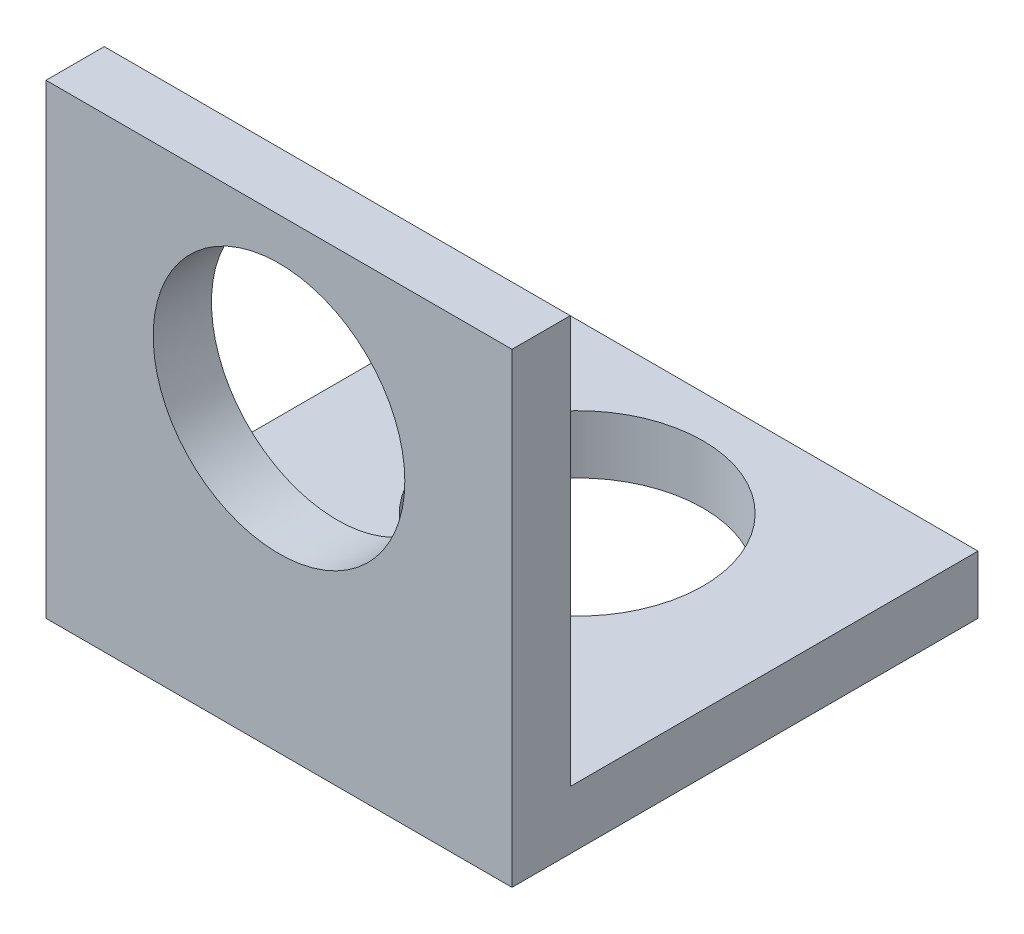
ISO-10303-21;
HEADER;
FILE_DESCRIPTION(('STEP AP214'),'2;1');
FILE_NAME('part.step','',(''),(''),'','','');
FILE_SCHEMA(('AUTOMOTIVE_DESIGN { 1 0 10303 214 1 1 1 1 }'));
ENDSEC;
DATA;
#1=APPLICATION_CONTEXT('core data for automotive mechanical design processes');
#2=APPLICATION_PROTOCOL_DEFINITION('international standard','automotive_design',2000,#1);
#3=PRODUCT_CONTEXT('',#1,'mechanical');
#4=PRODUCT('Part','Part','',(#3));
#5=PRODUCT_RELATED_PRODUCT_CATEGORY('part','',(#4));
#6=PRODUCT_DEFINITION_FORMATION('','',#4);
#7=PRODUCT_DEFINITION_CONTEXT('part definition',#1,'design');
#8=PRODUCT_DEFINITION('design','',#6,#7);
#9=PRODUCT_DEFINITION_SHAPE('','',#8);
#10=(LENGTH_UNIT() NAMED_UNIT(*) SI_UNIT(.MILLI.,.METRE.));
#11=(NAMED_UNIT(*) PLANE_ANGLE_UNIT() SI_UNIT($,.RADIAN.));
#12=(NAMED_UNIT(*) SI_UNIT($,.STERADIAN.) SOLID_ANGLE_UNIT());
#13=UNCERTAINTY_MEASURE_WITH_UNIT(LENGTH_MEASURE(1.E-05),#10,'distance_accuracy_value','');
#14=(GEOMETRIC_REPRESENTATION_CONTEXT(3) GLOBAL_UNCERTAINTY_ASSIGNED_CONTEXT((#13)) GLOBAL_UNIT_ASSIGNED_CONTEXT((#10,
#11,#12)) REPRESENTATION_CONTEXT('',''));
#15=CARTESIAN_POINT('',(0.,0.,0.));
#16=DIRECTION('',(0.,0.,1.));
#17=DIRECTION('',(1.,0.,0.));
#18=AXIS2_PLACEMENT_3D('',#15,#16,#17);
#19=CARTESIAN_POINT('',(12.7,0.,0.));
#20=DIRECTION('',(0.,1.,0.));
#21=DIRECTION('',(0.,0.,1.));
#22=AXIS2_PLACEMENT_3D('',#19,#20,#21);
#23=PLANE('',#22);
#24=CARTESIAN_POINT('',(6.35,0.,-8.128));
#25=DIRECTION('',(0.,-1.,0.));
#26=DIRECTION('',(0.,0.,-1.));
#27=AXIS2_PLACEMENT_3D('',#24,#25,#26);
#28=CIRCLE('',#27,3.429);
#29=CARTESIAN_POINT('',(6.35,0.,-11.557));
#30=VERTEX_POINT('',#29);
#31=EDGE_CURVE('E188',#30,#30,#28,.T.);
#32=ORIENTED_EDGE('',*,*,#31,.F.);
#33=EDGE_LOOP('',(#32));
#34=FACE_BOUND('',#33,.T.);
#35=DIRECTION('',(0.,0.,-1.));
#36=VECTOR('',#35,1.);
#37=CARTESIAN_POINT('',(0.,0.,0.));
#38=LINE('',#37,#36);
#39=CARTESIAN_POINT('',(0.,0.,0.));
#40=VERTEX_POINT('',#39);
#41=CARTESIAN_POINT('',(0.,0.,-12.7));
#42=VERTEX_POINT('',#41);
#43=EDGE_CURVE('E133',#40,#42,#38,.T.);
#44=ORIENTED_EDGE('',*,*,#43,.T.);
#45=DIRECTION('',(-1.,0.,0.));
#46=VECTOR('',#45,1.);
#47=CARTESIAN_POINT('',(12.7,0.,-12.7));
#48=LINE('',#47,#46);
#49=CARTESIAN_POINT('',(12.7,0.,-12.7));
#50=VERTEX_POINT('',#49);
#51=EDGE_CURVE('E11',#50,#42,#48,.T.);
#52=ORIENTED_EDGE('',*,*,#51,.F.);
#53=DIRECTION('',(0.,0.,-1.));
#54=VECTOR('',#53,1.);
#55=CARTESIAN_POINT('',(12.7,0.,0.));
#56=LINE('',#55,#54);
#57=CARTESIAN_POINT('',(12.7,0.,0.));
#58=VERTEX_POINT('',#57);
#59=EDGE_CURVE('E150',#58,#50,#56,.T.);
#60=ORIENTED_EDGE('',*,*,#59,.F.);
#61=DIRECTION('',(-1.,0.,0.));
#62=VECTOR('',#61,1.);
#63=CARTESIAN_POINT('',(12.7,0.,0.));
#64=LINE('',#63,#62);
#65=EDGE_CURVE('E129',#58,#40,#64,.T.);
#66=ORIENTED_EDGE('',*,*,#65,.T.);
#67=EDGE_LOOP('',(#44,#52,#60,#66));
#68=FACE_BOUND('',#67,.T.);
#69=ADVANCED_FACE('F43',(#34,#68),#23,.F.);
#70=CARTESIAN_POINT('',(12.7,1.5875,-12.7));
#71=DIRECTION('',(0.,0.,1.));
#72=DIRECTION('',(1.,0.,0.));
#73=AXIS2_PLACEMENT_3D('',#70,#71,#72);
#74=PLANE('',#73);
#75=DIRECTION('',(0.,1.,0.));
#76=VECTOR('',#75,1.);
#77=CARTESIAN_POINT('',(0.,1.5875,-12.7));
#78=LINE('',#77,#76);
#79=CARTESIAN_POINT('',(0.,1.5875,-12.7));
#80=VERTEX_POINT('',#79);
#81=EDGE_CURVE('E137',#42,#80,#78,.T.);
#82=ORIENTED_EDGE('',*,*,#81,.T.);
#83=DIRECTION('',(-1.,0.,0.));
#84=VECTOR('',#83,1.);
#85=CARTESIAN_POINT('',(12.7,1.5875,-12.7));
#86=LINE('',#85,#84);
#87=CARTESIAN_POINT('',(12.7,1.5875,-12.7));
#88=VERTEX_POINT('',#87);
#89=EDGE_CURVE('E53',#88,#80,#86,.T.);
#90=ORIENTED_EDGE('',*,*,#89,.F.);
#91=DIRECTION('',(0.,1.,0.));
#92=VECTOR('',#91,1.);
#93=CARTESIAN_POINT('',(12.7,1.5875,-12.7));
#94=LINE('',#93,#92);
#95=EDGE_CURVE('E98',#50,#88,#94,.T.);
#96=ORIENTED_EDGE('',*,*,#95,.F.);
#97=ORIENTED_EDGE('',*,*,#51,.T.);
#98=EDGE_LOOP('',(#82,#90,#96,#97));
#99=FACE_BOUND('',#98,.T.);
#100=ADVANCED_FACE('F181',(#99),#74,.F.);
#101=CARTESIAN_POINT('',(12.7,1.5875,-1.5875));
#102=DIRECTION('',(0.,-1.,0.));
#103=DIRECTION('',(0.,0.,-1.));
#104=AXIS2_PLACEMENT_3D('',#101,#102,#103);
#105=PLANE('',#104);
#106=CARTESIAN_POINT('',(6.35,1.5875,-8.128));
#107=DIRECTION('',(0.,-1.,0.));
#108=DIRECTION('',(0.,0.,-1.));
#109=AXIS2_PLACEMENT_3D('',#106,#107,#108);
#110=CIRCLE('',#109,3.429);
#111=CARTESIAN_POINT('',(6.35,1.5875,-11.557));
#112=VERTEX_POINT('',#111);
#113=EDGE_CURVE('E46',#112,#112,#110,.T.);
#114=ORIENTED_EDGE('',*,*,#113,.T.);
#115=EDGE_LOOP('',(#114));
#116=FACE_BOUND('',#115,.T.);
#117=DIRECTION('',(0.,0.,1.));
#118=VECTOR('',#117,1.);
#119=CARTESIAN_POINT('',(0.,1.5875,-1.5875));
#120=LINE('',#119,#118);
#121=CARTESIAN_POINT('',(0.,1.5875,-1.5875));
#122=VERTEX_POINT('',#121);
#123=EDGE_CURVE('E141',#80,#122,#120,.T.);
#124=ORIENTED_EDGE('',*,*,#123,.T.);
#125=DIRECTION('',(-1.,0.,0.));
#126=VECTOR('',#125,1.);
#127=CARTESIAN_POINT('',(12.7,1.5875,-1.5875));
#128=LINE('',#127,#126);
#129=CARTESIAN_POINT('',(12.7,1.5875,-1.5875));
#130=VERTEX_POINT('',#129);
#131=EDGE_CURVE('E122',#130,#122,#128,.T.);
#132=ORIENTED_EDGE('',*,*,#131,.F.);
#133=DIRECTION('',(0.,0.,1.));
#134=VECTOR('',#133,1.);
#135=CARTESIAN_POINT('',(12.7,1.5875,-1.5875));
#136=LINE('',#135,#134);
#137=EDGE_CURVE('E111',#88,#130,#136,.T.);
#138=ORIENTED_EDGE('',*,*,#137,.F.);
#139=ORIENTED_EDGE('',*,*,#89,.T.);
#140=EDGE_LOOP('',(#124,#132,#138,#139));
#141=FACE_BOUND('',#140,.T.);
#142=ADVANCED_FACE('F161',(#116,#141),#105,.F.);
#143=CARTESIAN_POINT('',(12.7,1.5875,-1.5875));
#144=DIRECTION('',(0.,0.,1.));
#145=DIRECTION('',(1.,0.,0.));
#146=AXIS2_PLACEMENT_3D('',#143,#144,#145);
#147=PLANE('',#146);
#148=CARTESIAN_POINT('',(6.35,8.128,-1.5875));
#149=DIRECTION('',(0.,0.,1.));
#150=DIRECTION('',(1.,0.,0.));
#151=AXIS2_PLACEMENT_3D('',#148,#149,#150);
#152=CIRCLE('',#151,3.42900000000001);
#153=CARTESIAN_POINT('',(9.77900000000001,8.128,-1.5875));
#154=VERTEX_POINT('',#153);
#155=EDGE_CURVE('E138',#154,#154,#152,.T.);
#156=ORIENTED_EDGE('',*,*,#155,.T.);
#157=EDGE_LOOP('',(#156));
#158=FACE_BOUND('',#157,.T.);
#159=DIRECTION('',(0.,1.,0.));
#160=VECTOR('',#159,1.);
#161=CARTESIAN_POINT('',(0.,1.5875,-1.5875));
#162=LINE('',#161,#160);
#163=CARTESIAN_POINT('',(0.,12.7,-1.5875));
#164=VERTEX_POINT('',#163);
#165=EDGE_CURVE('E120',#122,#164,#162,.T.);
#166=ORIENTED_EDGE('',*,*,#165,.T.);
#167=DIRECTION('',(-1.,0.,0.));
#168=VECTOR('',#167,1.);
#169=CARTESIAN_POINT('',(12.7,12.7,-1.5875));
#170=LINE('',#169,#168);
#171=CARTESIAN_POINT('',(12.7,12.7,-1.5875));
#172=VERTEX_POINT('',#171);
#173=EDGE_CURVE('E117',#172,#164,#170,.T.);
#174=ORIENTED_EDGE('',*,*,#173,.F.);
#175=DIRECTION('',(0.,1.,0.));
#176=VECTOR('',#175,1.);
#177=CARTESIAN_POINT('',(12.7,1.5875,-1.5875));
#178=LINE('',#177,#176);
#179=EDGE_CURVE('E105',#130,#172,#178,.T.);
#180=ORIENTED_EDGE('',*,*,#179,.F.);
#181=ORIENTED_EDGE('',*,*,#131,.T.);
#182=EDGE_LOOP('',(#166,#174,#180,#181));
#183=FACE_BOUND('',#182,.T.);
#184=ADVANCED_FACE('F118',(#158,#183),#147,.F.);
#185=CARTESIAN_POINT('',(12.7,12.7,0.));
#186=DIRECTION('',(0.,-1.,0.));
#187=DIRECTION('',(0.,0.,-1.));
#188=AXIS2_PLACEMENT_3D('',#185,#186,#187);
#189=PLANE('',#188);
#190=DIRECTION('',(0.,0.,1.));
#191=VECTOR('',#190,1.);
#192=CARTESIAN_POINT('',(0.,12.7,0.));
#193=LINE('',#192,#191);
#194=CARTESIAN_POINT('',(0.,12.7,0.));
#195=VERTEX_POINT('',#194);
#196=EDGE_CURVE('E84',#164,#195,#193,.T.);
#197=ORIENTED_EDGE('',*,*,#196,.T.);
#198=DIRECTION('',(-1.,0.,0.));
#199=VECTOR('',#198,1.);
#200=CARTESIAN_POINT('',(12.7,12.7,0.));
#201=LINE('',#200,#199);
#202=CARTESIAN_POINT('',(12.7,12.7,0.));
#203=VERTEX_POINT('',#202);
#204=EDGE_CURVE('E123',#203,#195,#201,.T.);
#205=ORIENTED_EDGE('',*,*,#204,.F.);
#206=DIRECTION('',(0.,0.,1.));
#207=VECTOR('',#206,1.);
#208=CARTESIAN_POINT('',(12.7,12.7,0.));
#209=LINE('',#208,#207);
#210=EDGE_CURVE('E109',#172,#203,#209,.T.);
#211=ORIENTED_EDGE('',*,*,#210,.F.);
#212=ORIENTED_EDGE('',*,*,#173,.T.);
#213=EDGE_LOOP('',(#197,#205,#211,#212));
#214=FACE_BOUND('',#213,.T.);
#215=ADVANCED_FACE('F125',(#214),#189,.F.);
#216=CARTESIAN_POINT('',(12.7,0.,0.));
#217=DIRECTION('',(0.,0.,-1.));
#218=DIRECTION('',(-1.,0.,0.));
#219=AXIS2_PLACEMENT_3D('',#216,#217,#218);
#220=PLANE('',#219);
#221=CARTESIAN_POINT('',(6.35,8.128,0.));
#222=DIRECTION('',(0.,0.,1.));
#223=DIRECTION('',(1.,0.,0.));
#224=AXIS2_PLACEMENT_3D('',#221,#222,#223);
#225=CIRCLE('',#224,3.42900000000001);
#226=CARTESIAN_POINT('',(9.77900000000001,8.128,0.));
#227=VERTEX_POINT('',#226);
#228=EDGE_CURVE('E194',#227,#227,#225,.T.);
#229=ORIENTED_EDGE('',*,*,#228,.F.);
#230=EDGE_LOOP('',(#229));
#231=FACE_BOUND('',#230,.T.);
#232=DIRECTION('',(0.,-1.,0.));
#233=VECTOR('',#232,1.);
#234=CARTESIAN_POINT('',(0.,0.,0.));
#235=LINE('',#234,#233);
#236=EDGE_CURVE('E90',#195,#40,#235,.T.);
#237=ORIENTED_EDGE('',*,*,#236,.T.);
#238=ORIENTED_EDGE('',*,*,#65,.F.);
#239=DIRECTION('',(0.,-1.,0.));
#240=VECTOR('',#239,1.);
#241=CARTESIAN_POINT('',(12.7,0.,0.));
#242=LINE('',#241,#240);
#243=EDGE_CURVE('E61',#203,#58,#242,.T.);
#244=ORIENTED_EDGE('',*,*,#243,.F.);
#245=ORIENTED_EDGE('',*,*,#204,.T.);
#246=EDGE_LOOP('',(#237,#238,#244,#245));
#247=FACE_BOUND('',#246,.T.);
#248=ADVANCED_FACE('F168',(#231,#247),#220,.F.);
#249=CARTESIAN_POINT('',(12.7,0.,0.));
#250=DIRECTION('',(-1.,0.,0.));
#251=DIRECTION('',(0.,0.,1.));
#252=AXIS2_PLACEMENT_3D('',#249,#250,#251);
#253=PLANE('',#252);
#254=ORIENTED_EDGE('',*,*,#59,.T.);
#255=ORIENTED_EDGE('',*,*,#95,.T.);
#256=ORIENTED_EDGE('',*,*,#137,.T.);
#257=ORIENTED_EDGE('',*,*,#179,.T.);
#258=ORIENTED_EDGE('',*,*,#210,.T.);
#259=ORIENTED_EDGE('',*,*,#243,.T.);
#260=EDGE_LOOP('',(#254,#255,#256,#257,#258,#259));
#261=FACE_BOUND('',#260,.T.);
#262=ADVANCED_FACE('F107',(#261),#253,.F.);
#263=CARTESIAN_POINT('',(0.,0.,0.));
#264=DIRECTION('',(-1.,0.,0.));
#265=DIRECTION('',(0.,0.,1.));
#266=AXIS2_PLACEMENT_3D('',#263,#264,#265);
#267=PLANE('',#266);
#268=ORIENTED_EDGE('',*,*,#43,.F.);
#269=ORIENTED_EDGE('',*,*,#236,.F.);
#270=ORIENTED_EDGE('',*,*,#196,.F.);
#271=ORIENTED_EDGE('',*,*,#165,.F.);
#272=ORIENTED_EDGE('',*,*,#123,.F.);
#273=ORIENTED_EDGE('',*,*,#81,.F.);
#274=EDGE_LOOP('',(#268,#269,#270,#271,#272,#273));
#275=FACE_BOUND('',#274,.T.);
#276=ADVANCED_FACE('F164',(#275),#267,.T.);
#277=CARTESIAN_POINT('',(6.35,8.128,-12.7));
#278=DIRECTION('',(0.,0.,1.));
#279=DIRECTION('',(1.,0.,0.));
#280=AXIS2_PLACEMENT_3D('',#277,#278,#279);
#281=CYLINDRICAL_SURFACE('',#280,3.42900000000001);
#282=ORIENTED_EDGE('',*,*,#228,.T.);
#283=EDGE_LOOP('',(#282));
#284=FACE_BOUND('',#283,.T.);
#285=ORIENTED_EDGE('',*,*,#155,.F.);
#286=EDGE_LOOP('',(#285));
#287=FACE_BOUND('',#286,.T.);
#288=ADVANCED_FACE('F209',(#284,#287),#281,.F.);
#289=CARTESIAN_POINT('',(6.35,12.7,-8.128));
#290=DIRECTION('',(0.,-1.,0.));
#291=DIRECTION('',(0.,0.,-1.));
#292=AXIS2_PLACEMENT_3D('',#289,#290,#291);
#293=CYLINDRICAL_SURFACE('',#292,3.429);
#294=ORIENTED_EDGE('',*,*,#31,.T.);
#295=EDGE_LOOP('',(#294));
#296=FACE_BOUND('',#295,.T.);
#297=ORIENTED_EDGE('',*,*,#113,.F.);
#298=EDGE_LOOP('',(#297));
#299=FACE_BOUND('',#298,.T.);
#300=ADVANCED_FACE('F211',(#296,#299),#293,.F.);
#301=CLOSED_SHELL('',(#69,#100,#142,#184,#215,#248,#262,#276,#288,#300));
#302=MANIFOLD_SOLID_BREP('B2',#301);
#303=ADVANCED_BREP_SHAPE_REPRESENTATION('',(#18,#302),#14);
#304=SHAPE_DEFINITION_REPRESENTATION(#9,#303);
ENDSEC;
END-ISO-10303-21;
